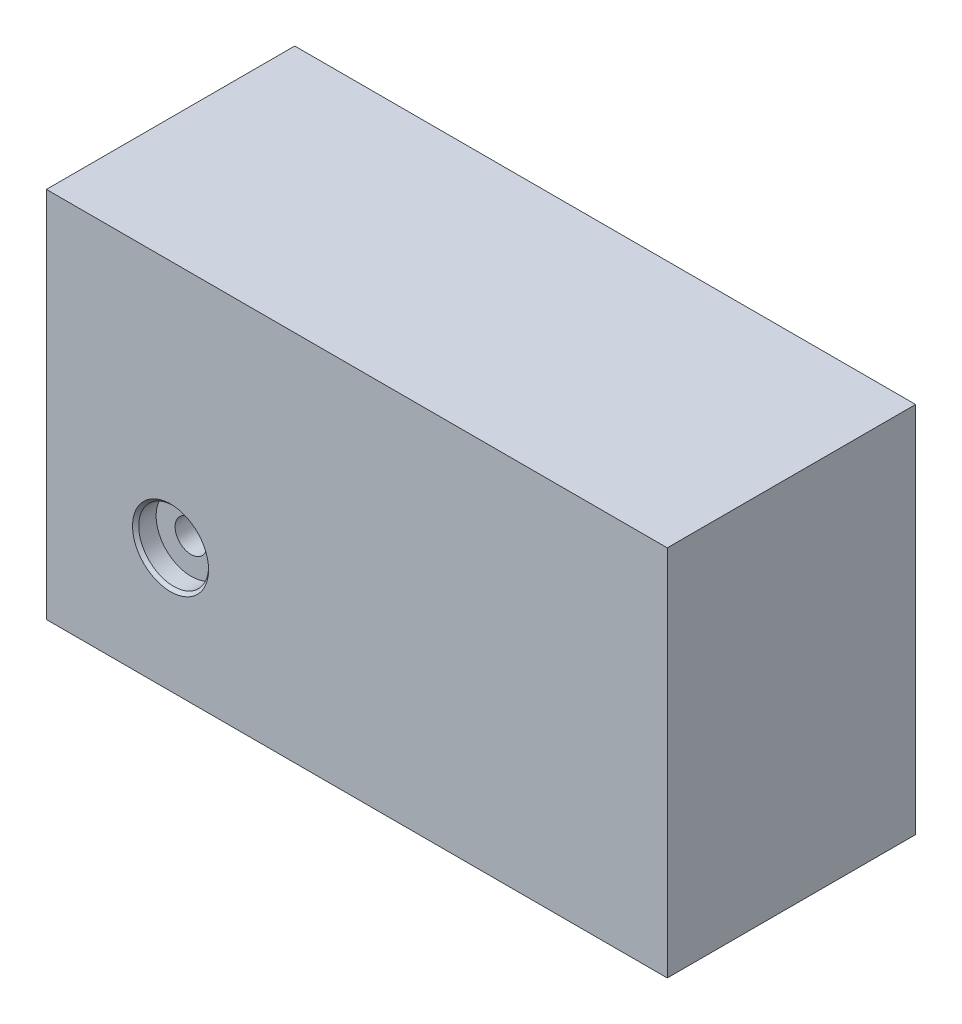
ISO-10303-21;
HEADER;
FILE_DESCRIPTION(('STEP AP214'),'2;1');
FILE_NAME('part.step','',(''),(''),'','','');
FILE_SCHEMA(('AUTOMOTIVE_DESIGN { 1 0 10303 214 1 1 1 1 }'));
ENDSEC;
DATA;
#1=APPLICATION_CONTEXT('core data for automotive mechanical design processes');
#2=APPLICATION_PROTOCOL_DEFINITION('international standard','automotive_design',2000,#1);
#3=PRODUCT_CONTEXT('',#1,'mechanical');
#4=PRODUCT('Part','Part','',(#3));
#5=PRODUCT_RELATED_PRODUCT_CATEGORY('part','',(#4));
#6=PRODUCT_DEFINITION_FORMATION('','',#4);
#7=PRODUCT_DEFINITION_CONTEXT('part definition',#1,'design');
#8=PRODUCT_DEFINITION('design','',#6,#7);
#9=PRODUCT_DEFINITION_SHAPE('','',#8);
#10=(LENGTH_UNIT() NAMED_UNIT(*) SI_UNIT(.MILLI.,.METRE.));
#11=(NAMED_UNIT(*) PLANE_ANGLE_UNIT() SI_UNIT($,.RADIAN.));
#12=(NAMED_UNIT(*) SI_UNIT($,.STERADIAN.) SOLID_ANGLE_UNIT());
#13=UNCERTAINTY_MEASURE_WITH_UNIT(LENGTH_MEASURE(1.E-05),#10,'distance_accuracy_value','');
#14=(GEOMETRIC_REPRESENTATION_CONTEXT(3) GLOBAL_UNCERTAINTY_ASSIGNED_CONTEXT((#13)) GLOBAL_UNIT_ASSIGNED_CONTEXT((#10,
#11,#12)) REPRESENTATION_CONTEXT('',''));
#15=CARTESIAN_POINT('',(0.,0.,0.));
#16=DIRECTION('',(0.,0.,1.));
#17=DIRECTION('',(1.,0.,0.));
#18=AXIS2_PLACEMENT_3D('',#15,#16,#17);
#19=CARTESIAN_POINT('',(0.,0.,50.8));
#20=DIRECTION('',(1.,0.,0.));
#21=DIRECTION('',(0.,0.,-1.));
#22=AXIS2_PLACEMENT_3D('',#19,#20,#21);
#23=PLANE('',#22);
#24=DIRECTION('',(0.,-1.,0.));
#25=VECTOR('',#24,1.);
#26=CARTESIAN_POINT('',(0.,0.,0.));
#27=LINE('',#26,#25);
#28=CARTESIAN_POINT('',(0.,76.2,0.));
#29=VERTEX_POINT('',#28);
#30=CARTESIAN_POINT('',(0.,0.,0.));
#31=VERTEX_POINT('',#30);
#32=EDGE_CURVE('E97',#29,#31,#27,.T.);
#33=ORIENTED_EDGE('',*,*,#32,.T.);
#34=DIRECTION('',(0.,0.,-1.));
#35=VECTOR('',#34,1.);
#36=CARTESIAN_POINT('',(0.,0.,50.8));
#37=LINE('',#36,#35);
#38=CARTESIAN_POINT('',(0.,0.,50.8));
#39=VERTEX_POINT('',#38);
#40=EDGE_CURVE('E11',#39,#31,#37,.T.);
#41=ORIENTED_EDGE('',*,*,#40,.F.);
#42=DIRECTION('',(0.,-1.,0.));
#43=VECTOR('',#42,1.);
#44=CARTESIAN_POINT('',(0.,0.,50.8));
#45=LINE('',#44,#43);
#46=CARTESIAN_POINT('',(0.,76.2,50.8));
#47=VERTEX_POINT('',#46);
#48=EDGE_CURVE('E85',#47,#39,#45,.T.);
#49=ORIENTED_EDGE('',*,*,#48,.F.);
#50=DIRECTION('',(0.,0.,-1.));
#51=VECTOR('',#50,1.);
#52=CARTESIAN_POINT('',(0.,76.2,50.8));
#53=LINE('',#52,#51);
#54=EDGE_CURVE('E93',#47,#29,#53,.T.);
#55=ORIENTED_EDGE('',*,*,#54,.T.);
#56=EDGE_LOOP('',(#33,#41,#49,#55));
#57=FACE_BOUND('',#56,.T.);
#58=ADVANCED_FACE('F34',(#57),#23,.F.);
#59=CARTESIAN_POINT('',(0.,0.,50.8));
#60=DIRECTION('',(0.,1.,0.));
#61=DIRECTION('',(0.,0.,1.));
#62=AXIS2_PLACEMENT_3D('',#59,#60,#61);
#63=PLANE('',#62);
#64=DIRECTION('',(1.,0.,0.));
#65=VECTOR('',#64,1.);
#66=CARTESIAN_POINT('',(0.,0.,0.));
#67=LINE('',#66,#65);
#68=CARTESIAN_POINT('',(127.,0.,0.));
#69=VERTEX_POINT('',#68);
#70=EDGE_CURVE('E89',#31,#69,#67,.T.);
#71=ORIENTED_EDGE('',*,*,#70,.T.);
#72=DIRECTION('',(0.,0.,-1.));
#73=VECTOR('',#72,1.);
#74=CARTESIAN_POINT('',(127.,0.,50.8));
#75=LINE('',#74,#73);
#76=CARTESIAN_POINT('',(127.,0.,50.8));
#77=VERTEX_POINT('',#76);
#78=EDGE_CURVE('E42',#77,#69,#75,.T.);
#79=ORIENTED_EDGE('',*,*,#78,.F.);
#80=DIRECTION('',(1.,0.,0.));
#81=VECTOR('',#80,1.);
#82=CARTESIAN_POINT('',(0.,0.,50.8));
#83=LINE('',#82,#81);
#84=EDGE_CURVE('E80',#39,#77,#83,.T.);
#85=ORIENTED_EDGE('',*,*,#84,.F.);
#86=ORIENTED_EDGE('',*,*,#40,.T.);
#87=EDGE_LOOP('',(#71,#79,#85,#86));
#88=FACE_BOUND('',#87,.T.);
#89=ADVANCED_FACE('F88',(#88),#63,.F.);
#90=CARTESIAN_POINT('',(127.,0.,50.8));
#91=DIRECTION('',(-1.,0.,0.));
#92=DIRECTION('',(0.,0.,1.));
#93=AXIS2_PLACEMENT_3D('',#90,#91,#92);
#94=PLANE('',#93);
#95=DIRECTION('',(0.,1.,0.));
#96=VECTOR('',#95,1.);
#97=CARTESIAN_POINT('',(127.,0.,0.));
#98=LINE('',#97,#96);
#99=CARTESIAN_POINT('',(127.,76.2,0.));
#100=VERTEX_POINT('',#99);
#101=EDGE_CURVE('E67',#69,#100,#98,.T.);
#102=ORIENTED_EDGE('',*,*,#101,.T.);
#103=DIRECTION('',(0.,0.,-1.));
#104=VECTOR('',#103,1.);
#105=CARTESIAN_POINT('',(127.,76.2,50.8));
#106=LINE('',#105,#104);
#107=CARTESIAN_POINT('',(127.,76.2,50.8));
#108=VERTEX_POINT('',#107);
#109=EDGE_CURVE('E90',#108,#100,#106,.T.);
#110=ORIENTED_EDGE('',*,*,#109,.F.);
#111=DIRECTION('',(0.,1.,0.));
#112=VECTOR('',#111,1.);
#113=CARTESIAN_POINT('',(127.,0.,50.8));
#114=LINE('',#113,#112);
#115=EDGE_CURVE('E83',#77,#108,#114,.T.);
#116=ORIENTED_EDGE('',*,*,#115,.F.);
#117=ORIENTED_EDGE('',*,*,#78,.T.);
#118=EDGE_LOOP('',(#102,#110,#116,#117));
#119=FACE_BOUND('',#118,.T.);
#120=ADVANCED_FACE('F91',(#119),#94,.F.);
#121=CARTESIAN_POINT('',(0.,76.2,50.8));
#122=DIRECTION('',(0.,-1.,0.));
#123=DIRECTION('',(0.,0.,-1.));
#124=AXIS2_PLACEMENT_3D('',#121,#122,#123);
#125=PLANE('',#124);
#126=DIRECTION('',(-1.,0.,0.));
#127=VECTOR('',#126,1.);
#128=CARTESIAN_POINT('',(0.,76.2,0.));
#129=LINE('',#128,#127);
#130=EDGE_CURVE('E73',#100,#29,#129,.T.);
#131=ORIENTED_EDGE('',*,*,#130,.T.);
#132=ORIENTED_EDGE('',*,*,#54,.F.);
#133=DIRECTION('',(-1.,0.,0.));
#134=VECTOR('',#133,1.);
#135=CARTESIAN_POINT('',(0.,76.2,50.8));
#136=LINE('',#135,#134);
#137=EDGE_CURVE('E50',#108,#47,#136,.T.);
#138=ORIENTED_EDGE('',*,*,#137,.F.);
#139=ORIENTED_EDGE('',*,*,#109,.T.);
#140=EDGE_LOOP('',(#131,#132,#138,#139));
#141=FACE_BOUND('',#140,.T.);
#142=ADVANCED_FACE('F105',(#141),#125,.F.);
#143=CARTESIAN_POINT('',(0.,0.,50.8));
#144=DIRECTION('',(0.,0.,-1.));
#145=DIRECTION('',(-1.,0.,0.));
#146=AXIS2_PLACEMENT_3D('',#143,#144,#145);
#147=PLANE('',#146);
#148=CARTESIAN_POINT('',(25.4,25.4,50.8));
#149=DIRECTION('',(0.,0.,1.));
#150=DIRECTION('',(1.,0.,0.));
#151=AXIS2_PLACEMENT_3D('',#148,#149,#150);
#152=CIRCLE('',#151,7.77875);
#153=CARTESIAN_POINT('',(33.17875,25.4,50.8));
#154=VERTEX_POINT('',#153);
#155=EDGE_CURVE('E122',#154,#154,#152,.T.);
#156=ORIENTED_EDGE('',*,*,#155,.F.);
#157=EDGE_LOOP('',(#156));
#158=FACE_BOUND('',#157,.T.);
#159=ORIENTED_EDGE('',*,*,#48,.T.);
#160=ORIENTED_EDGE('',*,*,#84,.T.);
#161=ORIENTED_EDGE('',*,*,#115,.T.);
#162=ORIENTED_EDGE('',*,*,#137,.T.);
#163=EDGE_LOOP('',(#159,#160,#161,#162));
#164=FACE_BOUND('',#163,.T.);
#165=ADVANCED_FACE('F81',(#158,#164),#147,.F.);
#166=CARTESIAN_POINT('',(0.,0.,0.));
#167=DIRECTION('',(0.,0.,-1.));
#168=DIRECTION('',(-1.,0.,0.));
#169=AXIS2_PLACEMENT_3D('',#166,#167,#168);
#170=PLANE('',#169);
#171=CARTESIAN_POINT('',(25.4,25.4,0.));
#172=DIRECTION('',(0.,0.,1.));
#173=DIRECTION('',(1.,0.,0.));
#174=AXIS2_PLACEMENT_3D('',#171,#172,#173);
#175=CIRCLE('',#174,3.26389999999999);
#176=CARTESIAN_POINT('',(28.6639,25.4,0.));
#177=VERTEX_POINT('',#176);
#178=EDGE_CURVE('E100',#177,#177,#175,.T.);
#179=ORIENTED_EDGE('',*,*,#178,.T.);
#180=EDGE_LOOP('',(#179));
#181=FACE_BOUND('',#180,.T.);
#182=ORIENTED_EDGE('',*,*,#32,.F.);
#183=ORIENTED_EDGE('',*,*,#130,.F.);
#184=ORIENTED_EDGE('',*,*,#101,.F.);
#185=ORIENTED_EDGE('',*,*,#70,.F.);
#186=EDGE_LOOP('',(#182,#183,#184,#185));
#187=FACE_BOUND('',#186,.T.);
#188=ADVANCED_FACE('F108',(#181,#187),#170,.T.);
#189=CARTESIAN_POINT('',(25.4,25.4,50.8));
#190=DIRECTION('',(0.,0.,1.));
#191=DIRECTION('',(1.,0.,0.));
#192=AXIS2_PLACEMENT_3D('',#189,#190,#191);
#193=CYLINDRICAL_SURFACE('',#192,3.2639);
#194=ORIENTED_EDGE('',*,*,#178,.F.);
#195=EDGE_LOOP('',(#194));
#196=FACE_BOUND('',#195,.T.);
#197=CARTESIAN_POINT('',(25.4,25.4,46.609));
#198=DIRECTION('',(0.,0.,1.));
#199=DIRECTION('',(1.,0.,0.));
#200=AXIS2_PLACEMENT_3D('',#197,#198,#199);
#201=CIRCLE('',#200,3.2639);
#202=CARTESIAN_POINT('',(28.6639,25.4,46.609));
#203=VERTEX_POINT('',#202);
#204=EDGE_CURVE('E113',#203,#203,#201,.T.);
#205=ORIENTED_EDGE('',*,*,#204,.T.);
#206=EDGE_LOOP('',(#205));
#207=FACE_BOUND('',#206,.T.);
#208=ADVANCED_FACE('F134',(#196,#207),#193,.F.);
#209=CARTESIAN_POINT('',(32.54375,25.4,46.609));
#210=DIRECTION('',(0.,0.,-1.));
#211=DIRECTION('',(-1.,0.,0.));
#212=AXIS2_PLACEMENT_3D('',#209,#210,#211);
#213=PLANE('',#212);
#214=ORIENTED_EDGE('',*,*,#204,.F.);
#215=EDGE_LOOP('',(#214));
#216=FACE_BOUND('',#215,.T.);
#217=CARTESIAN_POINT('',(25.4,25.4,46.609));
#218=DIRECTION('',(0.,0.,1.));
#219=DIRECTION('',(1.,0.,0.));
#220=AXIS2_PLACEMENT_3D('',#217,#218,#219);
#221=CIRCLE('',#220,7.14375);
#222=CARTESIAN_POINT('',(32.54375,25.4,46.609));
#223=VERTEX_POINT('',#222);
#224=EDGE_CURVE('E116',#223,#223,#221,.T.);
#225=ORIENTED_EDGE('',*,*,#224,.T.);
#226=EDGE_LOOP('',(#225));
#227=FACE_BOUND('',#226,.T.);
#228=ADVANCED_FACE('F172',(#216,#227),#213,.F.);
#229=CARTESIAN_POINT('',(25.4,25.4,50.8));
#230=DIRECTION('',(0.,0.,1.));
#231=DIRECTION('',(1.,0.,0.));
#232=AXIS2_PLACEMENT_3D('',#229,#230,#231);
#233=CYLINDRICAL_SURFACE('',#232,7.14375);
#234=ORIENTED_EDGE('',*,*,#224,.F.);
#235=EDGE_LOOP('',(#234));
#236=FACE_BOUND('',#235,.T.);
#237=CARTESIAN_POINT('',(25.4,25.4,50.165));
#238=DIRECTION('',(0.,0.,1.));
#239=DIRECTION('',(1.,0.,0.));
#240=AXIS2_PLACEMENT_3D('',#237,#238,#239);
#241=CIRCLE('',#240,7.14375);
#242=CARTESIAN_POINT('',(32.54375,25.4,50.165));
#243=VERTEX_POINT('',#242);
#244=EDGE_CURVE('E119',#243,#243,#241,.T.);
#245=ORIENTED_EDGE('',*,*,#244,.T.);
#246=EDGE_LOOP('',(#245));
#247=FACE_BOUND('',#246,.T.);
#248=ADVANCED_FACE('F181',(#236,#247),#233,.F.);
#249=CARTESIAN_POINT('',(25.4,25.4,50.8));
#250=DIRECTION('',(0.,0.,1.));
#251=DIRECTION('',(1.,0.,0.));
#252=AXIS2_PLACEMENT_3D('',#249,#250,#251);
#253=CONICAL_SURFACE('',#252,7.77875,0.785398163397448);
#254=ORIENTED_EDGE('',*,*,#244,.F.);
#255=EDGE_LOOP('',(#254));
#256=FACE_BOUND('',#255,.T.);
#257=ORIENTED_EDGE('',*,*,#155,.T.);
#258=EDGE_LOOP('',(#257));
#259=FACE_BOUND('',#258,.T.);
#260=ADVANCED_FACE('F126',(#256,#259),#253,.F.);
#261=CLOSED_SHELL('',(#58,#89,#120,#142,#165,#188,#208,#228,#248,#260));
#262=MANIFOLD_SOLID_BREP('B2',#261);
#263=ADVANCED_BREP_SHAPE_REPRESENTATION('',(#18,#262),#14);
#264=SHAPE_DEFINITION_REPRESENTATION(#9,#263);
ENDSEC;
END-ISO-10303-21;
